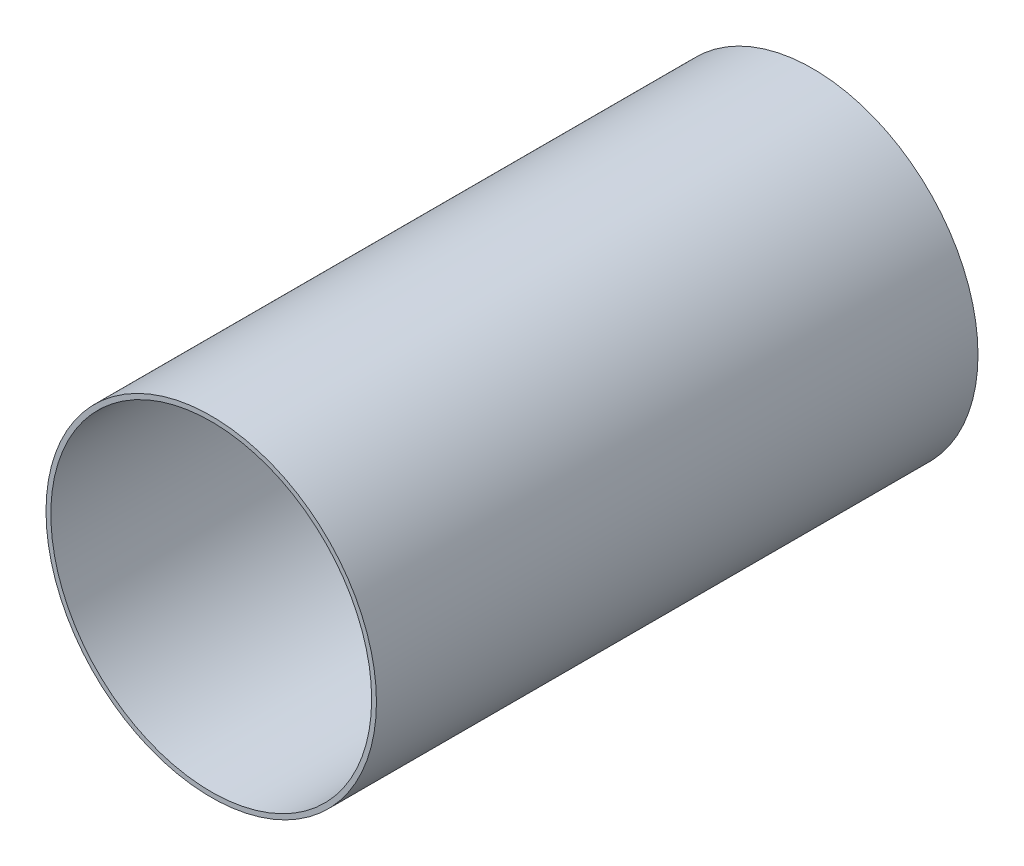
ISO-10303-21;
HEADER;
FILE_DESCRIPTION(('STEP AP214'),'2;1');
FILE_NAME('part.step','',(''),(''),'','','');
FILE_SCHEMA(('AUTOMOTIVE_DESIGN { 1 0 10303 214 1 1 1 1 }'));
ENDSEC;
DATA;
#1=APPLICATION_CONTEXT('core data for automotive mechanical design processes');
#2=APPLICATION_PROTOCOL_DEFINITION('international standard','automotive_design',2000,#1);
#3=PRODUCT_CONTEXT('',#1,'mechanical');
#4=PRODUCT('Part','Part','',(#3));
#5=PRODUCT_RELATED_PRODUCT_CATEGORY('part','',(#4));
#6=PRODUCT_DEFINITION_FORMATION('','',#4);
#7=PRODUCT_DEFINITION_CONTEXT('part definition',#1,'design');
#8=PRODUCT_DEFINITION('design','',#6,#7);
#9=PRODUCT_DEFINITION_SHAPE('','',#8);
#10=(LENGTH_UNIT() NAMED_UNIT(*) SI_UNIT(.MILLI.,.METRE.));
#11=(NAMED_UNIT(*) PLANE_ANGLE_UNIT() SI_UNIT($,.RADIAN.));
#12=(NAMED_UNIT(*) SI_UNIT($,.STERADIAN.) SOLID_ANGLE_UNIT());
#13=UNCERTAINTY_MEASURE_WITH_UNIT(LENGTH_MEASURE(1.E-05),#10,'distance_accuracy_value','');
#14=(GEOMETRIC_REPRESENTATION_CONTEXT(3) GLOBAL_UNCERTAINTY_ASSIGNED_CONTEXT((#13)) GLOBAL_UNIT_ASSIGNED_CONTEXT((#10,
#11,#12)) REPRESENTATION_CONTEXT('',''));
#15=CARTESIAN_POINT('',(0.,0.,0.));
#16=DIRECTION('',(0.,0.,1.));
#17=DIRECTION('',(1.,0.,0.));
#18=AXIS2_PLACEMENT_3D('',#15,#16,#17);
#19=CARTESIAN_POINT('',(0.,0.,150.));
#20=DIRECTION('',(0.,0.,1.));
#21=DIRECTION('',(1.,0.,0.));
#22=AXIS2_PLACEMENT_3D('',#19,#20,#21);
#23=PLANE('',#22);
#24=CARTESIAN_POINT('',(0.,0.,150.));
#25=DIRECTION('',(0.,0.,1.));
#26=DIRECTION('',(1.,0.,0.));
#27=AXIS2_PLACEMENT_3D('',#24,#25,#26);
#28=CIRCLE('',#27,41.2);
#29=CARTESIAN_POINT('',(41.2,0.,150.));
#30=VERTEX_POINT('',#29);
#31=EDGE_CURVE('E10',#30,#30,#28,.T.);
#32=ORIENTED_EDGE('',*,*,#31,.T.);
#33=EDGE_LOOP('',(#32));
#34=FACE_BOUND('',#33,.T.);
#35=CARTESIAN_POINT('',(0.,0.,150.));
#36=DIRECTION('',(0.,0.,1.));
#37=DIRECTION('',(1.,0.,0.));
#38=AXIS2_PLACEMENT_3D('',#35,#36,#37);
#39=CIRCLE('',#38,40.);
#40=CARTESIAN_POINT('',(40.,0.,150.));
#41=VERTEX_POINT('',#40);
#42=EDGE_CURVE('E46',#41,#41,#39,.T.);
#43=ORIENTED_EDGE('',*,*,#42,.F.);
#44=EDGE_LOOP('',(#43));
#45=FACE_BOUND('',#44,.T.);
#46=ADVANCED_FACE('F35',(#34,#45),#23,.T.);
#47=CARTESIAN_POINT('',(0.,0.,0.));
#48=DIRECTION('',(0.,0.,1.));
#49=DIRECTION('',(1.,0.,0.));
#50=AXIS2_PLACEMENT_3D('',#47,#48,#49);
#51=PLANE('',#50);
#52=CARTESIAN_POINT('',(0.,0.,0.));
#53=DIRECTION('',(0.,0.,1.));
#54=DIRECTION('',(1.,0.,0.));
#55=AXIS2_PLACEMENT_3D('',#52,#53,#54);
#56=CIRCLE('',#55,41.2);
#57=CARTESIAN_POINT('',(41.2,0.,0.));
#58=VERTEX_POINT('',#57);
#59=EDGE_CURVE('E39',#58,#58,#56,.T.);
#60=ORIENTED_EDGE('',*,*,#59,.F.);
#61=EDGE_LOOP('',(#60));
#62=FACE_BOUND('',#61,.T.);
#63=CARTESIAN_POINT('',(0.,0.,0.));
#64=DIRECTION('',(0.,0.,1.));
#65=DIRECTION('',(1.,0.,0.));
#66=AXIS2_PLACEMENT_3D('',#63,#64,#65);
#67=CIRCLE('',#66,40.);
#68=CARTESIAN_POINT('',(40.,0.,0.));
#69=VERTEX_POINT('',#68);
#70=EDGE_CURVE('E48',#69,#69,#67,.T.);
#71=ORIENTED_EDGE('',*,*,#70,.T.);
#72=EDGE_LOOP('',(#71));
#73=FACE_BOUND('',#72,.T.);
#74=ADVANCED_FACE('F58',(#62,#73),#51,.F.);
#75=CARTESIAN_POINT('',(0.,0.,150.));
#76=DIRECTION('',(0.,0.,-1.));
#77=DIRECTION('',(-1.,0.,0.));
#78=AXIS2_PLACEMENT_3D('',#75,#76,#77);
#79=CYLINDRICAL_SURFACE('',#78,41.2);
#80=ORIENTED_EDGE('',*,*,#31,.F.);
#81=EDGE_LOOP('',(#80));
#82=FACE_BOUND('',#81,.T.);
#83=ORIENTED_EDGE('',*,*,#59,.T.);
#84=EDGE_LOOP('',(#83));
#85=FACE_BOUND('',#84,.T.);
#86=ADVANCED_FACE('F37',(#82,#85),#79,.T.);
#87=CARTESIAN_POINT('',(0.,0.,150.));
#88=DIRECTION('',(0.,0.,-1.));
#89=DIRECTION('',(-1.,0.,0.));
#90=AXIS2_PLACEMENT_3D('',#87,#88,#89);
#91=CYLINDRICAL_SURFACE('',#90,40.);
#92=ORIENTED_EDGE('',*,*,#42,.T.);
#93=EDGE_LOOP('',(#92));
#94=FACE_BOUND('',#93,.T.);
#95=ORIENTED_EDGE('',*,*,#70,.F.);
#96=EDGE_LOOP('',(#95));
#97=FACE_BOUND('',#96,.T.);
#98=ADVANCED_FACE('F54',(#94,#97),#91,.F.);
#99=CLOSED_SHELL('',(#46,#74,#86,#98));
#100=MANIFOLD_SOLID_BREP('B2',#99);
#101=ADVANCED_BREP_SHAPE_REPRESENTATION('',(#18,#100),#14);
#102=SHAPE_DEFINITION_REPRESENTATION(#9,#101);
ENDSEC;
END-ISO-10303-21;
